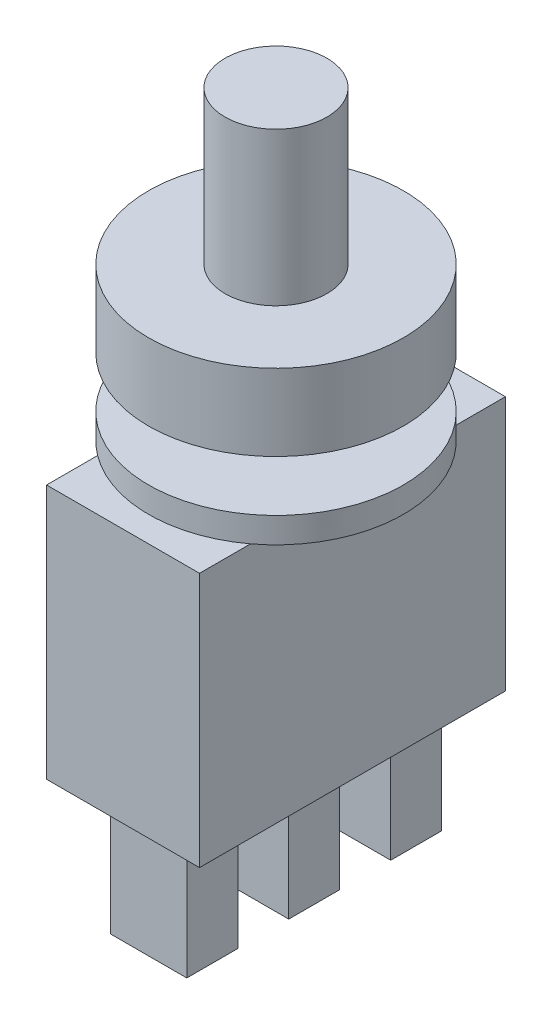
ISO-10303-21;
HEADER;
FILE_DESCRIPTION(('STEP AP214'),'2;1');
FILE_NAME('part.step','',(''),(''),'','','');
FILE_SCHEMA(('AUTOMOTIVE_DESIGN { 1 0 10303 214 1 1 1 1 }'));
ENDSEC;
DATA;
#1=APPLICATION_CONTEXT('core data for automotive mechanical design processes');
#2=APPLICATION_PROTOCOL_DEFINITION('international standard','automotive_design',2000,#1);
#3=PRODUCT_CONTEXT('',#1,'mechanical');
#4=PRODUCT('Part','Part','',(#3));
#5=PRODUCT_RELATED_PRODUCT_CATEGORY('part','',(#4));
#6=PRODUCT_DEFINITION_FORMATION('','',#4);
#7=PRODUCT_DEFINITION_CONTEXT('part definition',#1,'design');
#8=PRODUCT_DEFINITION('design','',#6,#7);
#9=PRODUCT_DEFINITION_SHAPE('','',#8);
#10=(LENGTH_UNIT() NAMED_UNIT(*) SI_UNIT(.MILLI.,.METRE.));
#11=(NAMED_UNIT(*) PLANE_ANGLE_UNIT() SI_UNIT($,.RADIAN.));
#12=(NAMED_UNIT(*) SI_UNIT($,.STERADIAN.) SOLID_ANGLE_UNIT());
#13=UNCERTAINTY_MEASURE_WITH_UNIT(LENGTH_MEASURE(1.E-05),#10,'distance_accuracy_value','');
#14=(GEOMETRIC_REPRESENTATION_CONTEXT(3) GLOBAL_UNCERTAINTY_ASSIGNED_CONTEXT((#13)) GLOBAL_UNIT_ASSIGNED_CONTEXT((#10,
#11,#12)) REPRESENTATION_CONTEXT('',''));
#15=CARTESIAN_POINT('',(0.,0.,0.));
#16=DIRECTION('',(0.,0.,1.));
#17=DIRECTION('',(1.,0.,0.));
#18=AXIS2_PLACEMENT_3D('',#15,#16,#17);
#19=CARTESIAN_POINT('',(3.,-13.,-6.));
#20=DIRECTION('',(0.,-1.,0.));
#21=DIRECTION('',(0.,0.,-1.));
#22=AXIS2_PLACEMENT_3D('',#19,#20,#21);
#23=PLANE('',#22);
#24=DIRECTION('',(1.,0.,0.));
#25=VECTOR('',#24,1.);
#26=CARTESIAN_POINT('',(-1.5,-13.,-1.));
#27=LINE('',#26,#25);
#28=CARTESIAN_POINT('',(-1.5,-13.,-1.));
#29=VERTEX_POINT('',#28);
#30=CARTESIAN_POINT('',(1.5,-13.,-1.));
#31=VERTEX_POINT('',#30);
#32=EDGE_CURVE('E202',#29,#31,#27,.T.);
#33=ORIENTED_EDGE('',*,*,#32,.F.);
#34=DIRECTION('',(0.,0.,-1.));
#35=VECTOR('',#34,1.);
#36=CARTESIAN_POINT('',(-1.5,-13.,-1.));
#37=LINE('',#36,#35);
#38=CARTESIAN_POINT('',(-1.5,-13.,1.));
#39=VERTEX_POINT('',#38);
#40=EDGE_CURVE('E171',#39,#29,#37,.T.);
#41=ORIENTED_EDGE('',*,*,#40,.F.);
#42=DIRECTION('',(-1.,0.,0.));
#43=VECTOR('',#42,1.);
#44=CARTESIAN_POINT('',(-1.5,-13.,1.));
#45=LINE('',#44,#43);
#46=CARTESIAN_POINT('',(1.5,-13.,1.));
#47=VERTEX_POINT('',#46);
#48=EDGE_CURVE('E206',#47,#39,#45,.T.);
#49=ORIENTED_EDGE('',*,*,#48,.F.);
#50=DIRECTION('',(0.,0.,1.));
#51=VECTOR('',#50,1.);
#52=CARTESIAN_POINT('',(1.5,-13.,-1.));
#53=LINE('',#52,#51);
#54=EDGE_CURVE('E204',#31,#47,#53,.T.);
#55=ORIENTED_EDGE('',*,*,#54,.F.);
#56=EDGE_LOOP('',(#33,#41,#49,#55));
#57=FACE_BOUND('',#56,.T.);
#58=DIRECTION('',(0.,0.,1.));
#59=VECTOR('',#58,1.);
#60=CARTESIAN_POINT('',(3.,-13.,-6.));
#61=LINE('',#60,#59);
#62=CARTESIAN_POINT('',(3.,-13.,-6.));
#63=VERTEX_POINT('',#62);
#64=CARTESIAN_POINT('',(3.,-13.,6.));
#65=VERTEX_POINT('',#64);
#66=EDGE_CURVE('E264',#63,#65,#61,.T.);
#67=ORIENTED_EDGE('',*,*,#66,.T.);
#68=DIRECTION('',(-1.,0.,0.));
#69=VECTOR('',#68,1.);
#70=CARTESIAN_POINT('',(3.,-13.,6.));
#71=LINE('',#70,#69);
#72=CARTESIAN_POINT('',(-3.,-13.,6.));
#73=VERTEX_POINT('',#72);
#74=EDGE_CURVE('E267',#65,#73,#71,.T.);
#75=ORIENTED_EDGE('',*,*,#74,.T.);
#76=DIRECTION('',(0.,0.,-1.));
#77=VECTOR('',#76,1.);
#78=CARTESIAN_POINT('',(-3.,-13.,-6.));
#79=LINE('',#78,#77);
#80=CARTESIAN_POINT('',(-3.,-13.,-6.));
#81=VERTEX_POINT('',#80);
#82=EDGE_CURVE('E269',#73,#81,#79,.T.);
#83=ORIENTED_EDGE('',*,*,#82,.T.);
#84=DIRECTION('',(1.,0.,0.));
#85=VECTOR('',#84,1.);
#86=CARTESIAN_POINT('',(3.,-13.,-6.));
#87=LINE('',#86,#85);
#88=EDGE_CURVE('E271',#81,#63,#87,.T.);
#89=ORIENTED_EDGE('',*,*,#88,.T.);
#90=EDGE_LOOP('',(#67,#75,#83,#89));
#91=FACE_BOUND('',#90,.T.);
#92=DIRECTION('',(1.,0.,0.));
#93=VECTOR('',#92,1.);
#94=CARTESIAN_POINT('',(-1.5,-13.,3.));
#95=LINE('',#94,#93);
#96=CARTESIAN_POINT('',(-1.5,-13.,3.));
#97=VERTEX_POINT('',#96);
#98=CARTESIAN_POINT('',(1.5,-13.,3.));
#99=VERTEX_POINT('',#98);
#100=EDGE_CURVE('E229',#97,#99,#95,.T.);
#101=ORIENTED_EDGE('',*,*,#100,.F.);
#102=DIRECTION('',(0.,0.,-1.));
#103=VECTOR('',#102,1.);
#104=CARTESIAN_POINT('',(-1.5,-13.,3.));
#105=LINE('',#104,#103);
#106=CARTESIAN_POINT('',(-1.5,-13.,5.));
#107=VERTEX_POINT('',#106);
#108=EDGE_CURVE('E226',#107,#97,#105,.T.);
#109=ORIENTED_EDGE('',*,*,#108,.F.);
#110=DIRECTION('',(-1.,0.,0.));
#111=VECTOR('',#110,1.);
#112=CARTESIAN_POINT('',(-1.5,-13.,5.));
#113=LINE('',#112,#111);
#114=CARTESIAN_POINT('',(1.5,-13.,5.));
#115=VERTEX_POINT('',#114);
#116=EDGE_CURVE('E234',#115,#107,#113,.T.);
#117=ORIENTED_EDGE('',*,*,#116,.F.);
#118=DIRECTION('',(0.,0.,1.));
#119=VECTOR('',#118,1.);
#120=CARTESIAN_POINT('',(1.5,-13.,3.));
#121=LINE('',#120,#119);
#122=EDGE_CURVE('E231',#99,#115,#121,.T.);
#123=ORIENTED_EDGE('',*,*,#122,.F.);
#124=EDGE_LOOP('',(#101,#109,#117,#123));
#125=FACE_BOUND('',#124,.T.);
#126=DIRECTION('',(1.,0.,0.));
#127=VECTOR('',#126,1.);
#128=CARTESIAN_POINT('',(-1.5,-13.,-5.));
#129=LINE('',#128,#127);
#130=CARTESIAN_POINT('',(-1.5,-13.,-5.));
#131=VERTEX_POINT('',#130);
#132=CARTESIAN_POINT('',(1.5,-13.,-5.));
#133=VERTEX_POINT('',#132);
#134=EDGE_CURVE('E165',#131,#133,#129,.T.);
#135=ORIENTED_EDGE('',*,*,#134,.F.);
#136=DIRECTION('',(0.,0.,-1.));
#137=VECTOR('',#136,1.);
#138=CARTESIAN_POINT('',(-1.5,-13.,-5.));
#139=LINE('',#138,#137);
#140=CARTESIAN_POINT('',(-1.5,-13.,-3.));
#141=VERTEX_POINT('',#140);
#142=EDGE_CURVE('E176',#141,#131,#139,.T.);
#143=ORIENTED_EDGE('',*,*,#142,.F.);
#144=DIRECTION('',(-1.,0.,0.));
#145=VECTOR('',#144,1.);
#146=CARTESIAN_POINT('',(-1.5,-13.,-3.));
#147=LINE('',#146,#145);
#148=CARTESIAN_POINT('',(1.5,-13.,-3.));
#149=VERTEX_POINT('',#148);
#150=EDGE_CURVE('E186',#149,#141,#147,.T.);
#151=ORIENTED_EDGE('',*,*,#150,.F.);
#152=DIRECTION('',(0.,0.,1.));
#153=VECTOR('',#152,1.);
#154=CARTESIAN_POINT('',(1.5,-13.,-5.));
#155=LINE('',#154,#153);
#156=EDGE_CURVE('E184',#133,#149,#155,.T.);
#157=ORIENTED_EDGE('',*,*,#156,.F.);
#158=EDGE_LOOP('',(#135,#143,#151,#157));
#159=FACE_BOUND('',#158,.T.);
#160=ADVANCED_FACE('F30',(#57,#91,#125,#159),#23,.T.);
#161=CARTESIAN_POINT('',(0.,-3.,0.));
#162=DIRECTION('',(0.,-1.,0.));
#163=DIRECTION('',(0.,0.,-1.));
#164=AXIS2_PLACEMENT_3D('',#161,#162,#163);
#165=PLANE('',#164);
#166=DIRECTION('',(0.,0.,1.));
#167=VECTOR('',#166,1.);
#168=CARTESIAN_POINT('',(3.,-3.,-6.));
#169=LINE('',#168,#167);
#170=CARTESIAN_POINT('',(3.,-3.,-4.));
#171=VERTEX_POINT('',#170);
#172=CARTESIAN_POINT('',(3.,-3.,4.));
#173=VERTEX_POINT('',#172);
#174=EDGE_CURVE('E11',#171,#173,#169,.T.);
#175=ORIENTED_EDGE('',*,*,#174,.F.);
#176=CARTESIAN_POINT('',(0.,-3.,0.));
#177=DIRECTION('',(0.,-1.,0.));
#178=DIRECTION('',(0.,0.,-1.));
#179=AXIS2_PLACEMENT_3D('',#176,#177,#178);
#180=CIRCLE('',#179,5.);
#181=EDGE_CURVE('E289',#171,#173,#180,.T.);
#182=ORIENTED_EDGE('',*,*,#181,.T.);
#183=EDGE_LOOP('',(#175,#182));
#184=FACE_BOUND('',#183,.T.);
#185=ADVANCED_FACE('F350',(#184),#165,.T.);
#186=CARTESIAN_POINT('',(0.,0.,0.));
#187=DIRECTION('',(0.,1.,0.));
#188=DIRECTION('',(0.,0.,1.));
#189=AXIS2_PLACEMENT_3D('',#186,#187,#188);
#190=PLANE('',#189);
#191=CARTESIAN_POINT('',(0.,0.,0.));
#192=DIRECTION('',(0.,1.,0.));
#193=DIRECTION('',(0.,0.,1.));
#194=AXIS2_PLACEMENT_3D('',#191,#192,#193);
#195=CIRCLE('',#194,5.);
#196=CARTESIAN_POINT('',(0.,0.,5.));
#197=VERTEX_POINT('',#196);
#198=EDGE_CURVE('E302',#197,#197,#195,.T.);
#199=ORIENTED_EDGE('',*,*,#198,.F.);
#200=EDGE_LOOP('',(#199));
#201=FACE_BOUND('',#200,.T.);
#202=CARTESIAN_POINT('',(0.,0.,0.));
#203=DIRECTION('',(0.,1.,0.));
#204=DIRECTION('',(0.,0.,1.));
#205=AXIS2_PLACEMENT_3D('',#202,#203,#204);
#206=CIRCLE('',#205,2.);
#207=CARTESIAN_POINT('',(0.,0.,2.));
#208=VERTEX_POINT('',#207);
#209=EDGE_CURVE('E34',#208,#208,#206,.F.);
#210=ORIENTED_EDGE('',*,*,#209,.F.);
#211=EDGE_LOOP('',(#210));
#212=FACE_BOUND('',#211,.T.);
#213=ADVANCED_FACE('F352',(#201,#212),#190,.F.);
#214=CARTESIAN_POINT('',(0.,3.,0.));
#215=DIRECTION('',(0.,1.,0.));
#216=DIRECTION('',(0.,0.,1.));
#217=AXIS2_PLACEMENT_3D('',#214,#215,#216);
#218=PLANE('',#217);
#219=CARTESIAN_POINT('',(0.,3.,0.));
#220=DIRECTION('',(0.,1.,0.));
#221=DIRECTION('',(0.,0.,1.));
#222=AXIS2_PLACEMENT_3D('',#219,#220,#221);
#223=CIRCLE('',#222,5.);
#224=CARTESIAN_POINT('',(0.,3.,5.));
#225=VERTEX_POINT('',#224);
#226=EDGE_CURVE('E304',#225,#225,#223,.T.);
#227=ORIENTED_EDGE('',*,*,#226,.T.);
#228=EDGE_LOOP('',(#227));
#229=FACE_BOUND('',#228,.T.);
#230=CARTESIAN_POINT('',(0.,3.,0.));
#231=DIRECTION('',(0.,1.,0.));
#232=DIRECTION('',(0.,0.,1.));
#233=AXIS2_PLACEMENT_3D('',#230,#231,#232);
#234=CIRCLE('',#233,2.);
#235=CARTESIAN_POINT('',(0.,3.,2.));
#236=VERTEX_POINT('',#235);
#237=EDGE_CURVE('E296',#236,#236,#234,.T.);
#238=ORIENTED_EDGE('',*,*,#237,.F.);
#239=EDGE_LOOP('',(#238));
#240=FACE_BOUND('',#239,.T.);
#241=ADVANCED_FACE('F358',(#229,#240),#218,.T.);
#242=CARTESIAN_POINT('',(0.,3.,0.));
#243=DIRECTION('',(0.,-1.,0.));
#244=DIRECTION('',(0.,0.,-1.));
#245=AXIS2_PLACEMENT_3D('',#242,#243,#244);
#246=CYLINDRICAL_SURFACE('',#245,5.);
#247=ORIENTED_EDGE('',*,*,#226,.F.);
#248=EDGE_LOOP('',(#247));
#249=FACE_BOUND('',#248,.T.);
#250=ORIENTED_EDGE('',*,*,#198,.T.);
#251=EDGE_LOOP('',(#250));
#252=FACE_BOUND('',#251,.T.);
#253=ADVANCED_FACE('F32',(#249,#252),#246,.T.);
#254=CARTESIAN_POINT('',(0.,9.,0.));
#255=DIRECTION('',(0.,-1.,0.));
#256=DIRECTION('',(0.,0.,-1.));
#257=AXIS2_PLACEMENT_3D('',#254,#255,#256);
#258=CYLINDRICAL_SURFACE('',#257,2.);
#259=CARTESIAN_POINT('',(0.,9.,0.));
#260=DIRECTION('',(0.,1.,0.));
#261=DIRECTION('',(0.,0.,1.));
#262=AXIS2_PLACEMENT_3D('',#259,#260,#261);
#263=CIRCLE('',#262,2.);
#264=CARTESIAN_POINT('',(0.,9.,2.));
#265=VERTEX_POINT('',#264);
#266=EDGE_CURVE('E299',#265,#265,#263,.T.);
#267=ORIENTED_EDGE('',*,*,#266,.F.);
#268=EDGE_LOOP('',(#267));
#269=FACE_BOUND('',#268,.T.);
#270=ORIENTED_EDGE('',*,*,#237,.T.);
#271=EDGE_LOOP('',(#270));
#272=FACE_BOUND('',#271,.T.);
#273=ADVANCED_FACE('F384',(#269,#272),#258,.T.);
#274=CARTESIAN_POINT('',(0.,9.,0.));
#275=DIRECTION('',(0.,1.,0.));
#276=DIRECTION('',(0.,0.,1.));
#277=AXIS2_PLACEMENT_3D('',#274,#275,#276);
#278=PLANE('',#277);
#279=ORIENTED_EDGE('',*,*,#266,.T.);
#280=EDGE_LOOP('',(#279));
#281=FACE_BOUND('',#280,.T.);
#282=ADVANCED_FACE('F380',(#281),#278,.T.);
#283=CARTESIAN_POINT('',(0.,-2.,0.));
#284=DIRECTION('',(0.,1.,0.));
#285=DIRECTION('',(0.,0.,1.));
#286=AXIS2_PLACEMENT_3D('',#283,#284,#285);
#287=CYLINDRICAL_SURFACE('',#286,2.);
#288=CARTESIAN_POINT('',(0.,-2.,0.));
#289=DIRECTION('',(0.,-1.,0.));
#290=DIRECTION('',(0.,0.,-1.));
#291=AXIS2_PLACEMENT_3D('',#288,#289,#290);
#292=CIRCLE('',#291,2.);
#293=CARTESIAN_POINT('',(0.,-2.,-2.));
#294=VERTEX_POINT('',#293);
#295=EDGE_CURVE('E292',#294,#294,#292,.T.);
#296=ORIENTED_EDGE('',*,*,#295,.F.);
#297=EDGE_LOOP('',(#296));
#298=FACE_BOUND('',#297,.T.);
#299=ORIENTED_EDGE('',*,*,#209,.T.);
#300=EDGE_LOOP('',(#299));
#301=FACE_BOUND('',#300,.T.);
#302=ADVANCED_FACE('F375',(#298,#301),#287,.T.);
#303=CARTESIAN_POINT('',(0.,-2.,0.));
#304=DIRECTION('',(0.,-1.,0.));
#305=DIRECTION('',(0.,0.,-1.));
#306=AXIS2_PLACEMENT_3D('',#303,#304,#305);
#307=PLANE('',#306);
#308=CARTESIAN_POINT('',(0.,-2.,0.));
#309=DIRECTION('',(0.,-1.,0.));
#310=DIRECTION('',(0.,0.,-1.));
#311=AXIS2_PLACEMENT_3D('',#308,#309,#310);
#312=CIRCLE('',#311,5.);
#313=CARTESIAN_POINT('',(0.,-2.,-5.));
#314=VERTEX_POINT('',#313);
#315=EDGE_CURVE('E285',#314,#314,#312,.T.);
#316=ORIENTED_EDGE('',*,*,#315,.F.);
#317=EDGE_LOOP('',(#316));
#318=FACE_BOUND('',#317,.T.);
#319=ORIENTED_EDGE('',*,*,#295,.T.);
#320=EDGE_LOOP('',(#319));
#321=FACE_BOUND('',#320,.T.);
#322=ADVANCED_FACE('F371',(#318,#321),#307,.F.);
#323=CARTESIAN_POINT('',(0.,-3.,0.));
#324=DIRECTION('',(0.,1.,0.));
#325=DIRECTION('',(0.,0.,1.));
#326=AXIS2_PLACEMENT_3D('',#323,#324,#325);
#327=CYLINDRICAL_SURFACE('',#326,5.);
#328=ORIENTED_EDGE('',*,*,#181,.F.);
#329=CARTESIAN_POINT('',(-3.,-3.,-4.));
#330=VERTEX_POINT('',#329);
#331=EDGE_CURVE('E288',#330,#171,#180,.T.);
#332=ORIENTED_EDGE('',*,*,#331,.F.);
#333=CARTESIAN_POINT('',(-3.,-3.,4.));
#334=VERTEX_POINT('',#333);
#335=EDGE_CURVE('E344',#334,#330,#180,.T.);
#336=ORIENTED_EDGE('',*,*,#335,.F.);
#337=EDGE_CURVE('E293',#173,#334,#180,.T.);
#338=ORIENTED_EDGE('',*,*,#337,.F.);
#339=EDGE_LOOP('',(#328,#332,#336,#338));
#340=FACE_BOUND('',#339,.T.);
#341=ORIENTED_EDGE('',*,*,#315,.T.);
#342=EDGE_LOOP('',(#341));
#343=FACE_BOUND('',#342,.T.);
#344=ADVANCED_FACE('F347',(#340,#343),#327,.T.);
#345=DIRECTION('',(0.,0.,-1.));
#346=VECTOR('',#345,1.);
#347=CARTESIAN_POINT('',(-3.,-3.,-6.));
#348=LINE('',#347,#346);
#349=EDGE_CURVE('E39',#334,#330,#348,.T.);
#350=ORIENTED_EDGE('',*,*,#349,.F.);
#351=ORIENTED_EDGE('',*,*,#335,.T.);
#352=EDGE_LOOP('',(#350,#351));
#353=FACE_BOUND('',#352,.T.);
#354=ADVANCED_FACE('F346',(#353),#165,.T.);
#355=CARTESIAN_POINT('',(3.,-3.,-6.));
#356=DIRECTION('',(0.,-1.,0.));
#357=DIRECTION('',(0.,0.,-1.));
#358=AXIS2_PLACEMENT_3D('',#355,#356,#357);
#359=PLANE('',#358);
#360=CARTESIAN_POINT('',(3.,-3.,6.));
#361=VERTEX_POINT('',#360);
#362=EDGE_CURVE('E42',#173,#361,#169,.T.);
#363=ORIENTED_EDGE('',*,*,#362,.F.);
#364=ORIENTED_EDGE('',*,*,#337,.T.);
#365=CARTESIAN_POINT('',(-3.,-3.,6.));
#366=VERTEX_POINT('',#365);
#367=EDGE_CURVE('E259',#366,#334,#348,.T.);
#368=ORIENTED_EDGE('',*,*,#367,.F.);
#369=DIRECTION('',(-1.,0.,0.));
#370=VECTOR('',#369,1.);
#371=CARTESIAN_POINT('',(3.,-3.,6.));
#372=LINE('',#371,#370);
#373=EDGE_CURVE('E256',#361,#366,#372,.T.);
#374=ORIENTED_EDGE('',*,*,#373,.F.);
#375=EDGE_LOOP('',(#363,#364,#368,#374));
#376=FACE_BOUND('',#375,.T.);
#377=ADVANCED_FACE('F340',(#376),#359,.F.);
#378=CARTESIAN_POINT('',(-3.,-3.,-6.));
#379=VERTEX_POINT('',#378);
#380=EDGE_CURVE('E258',#330,#379,#348,.T.);
#381=ORIENTED_EDGE('',*,*,#380,.F.);
#382=ORIENTED_EDGE('',*,*,#331,.T.);
#383=CARTESIAN_POINT('',(3.,-3.,-6.));
#384=VERTEX_POINT('',#383);
#385=EDGE_CURVE('E41',#384,#171,#169,.T.);
#386=ORIENTED_EDGE('',*,*,#385,.F.);
#387=DIRECTION('',(1.,0.,0.));
#388=VECTOR('',#387,1.);
#389=CARTESIAN_POINT('',(3.,-3.,-6.));
#390=LINE('',#389,#388);
#391=EDGE_CURVE('E262',#379,#384,#390,.T.);
#392=ORIENTED_EDGE('',*,*,#391,.F.);
#393=EDGE_LOOP('',(#381,#382,#386,#392));
#394=FACE_BOUND('',#393,.T.);
#395=ADVANCED_FACE('F325',(#394),#359,.F.);
#396=CARTESIAN_POINT('',(3.,-13.,-6.));
#397=DIRECTION('',(-1.,0.,0.));
#398=DIRECTION('',(0.,0.,1.));
#399=AXIS2_PLACEMENT_3D('',#396,#397,#398);
#400=PLANE('',#399);
#401=ORIENTED_EDGE('',*,*,#385,.T.);
#402=ORIENTED_EDGE('',*,*,#174,.T.);
#403=ORIENTED_EDGE('',*,*,#362,.T.);
#404=DIRECTION('',(0.,1.,0.));
#405=VECTOR('',#404,1.);
#406=CARTESIAN_POINT('',(3.,-13.,6.));
#407=LINE('',#406,#405);
#408=EDGE_CURVE('E282',#65,#361,#407,.T.);
#409=ORIENTED_EDGE('',*,*,#408,.F.);
#410=ORIENTED_EDGE('',*,*,#66,.F.);
#411=DIRECTION('',(0.,1.,0.));
#412=VECTOR('',#411,1.);
#413=CARTESIAN_POINT('',(3.,-13.,-6.));
#414=LINE('',#413,#412);
#415=EDGE_CURVE('E273',#63,#384,#414,.T.);
#416=ORIENTED_EDGE('',*,*,#415,.T.);
#417=EDGE_LOOP('',(#401,#402,#403,#409,#410,#416));
#418=FACE_BOUND('',#417,.T.);
#419=ADVANCED_FACE('F328',(#418),#400,.F.);
#420=CARTESIAN_POINT('',(3.,-13.,6.));
#421=DIRECTION('',(0.,0.,-1.));
#422=DIRECTION('',(-1.,0.,0.));
#423=AXIS2_PLACEMENT_3D('',#420,#421,#422);
#424=PLANE('',#423);
#425=ORIENTED_EDGE('',*,*,#373,.T.);
#426=DIRECTION('',(0.,1.,0.));
#427=VECTOR('',#426,1.);
#428=CARTESIAN_POINT('',(-3.,-13.,6.));
#429=LINE('',#428,#427);
#430=EDGE_CURVE('E279',#73,#366,#429,.T.);
#431=ORIENTED_EDGE('',*,*,#430,.F.);
#432=ORIENTED_EDGE('',*,*,#74,.F.);
#433=ORIENTED_EDGE('',*,*,#408,.T.);
#434=EDGE_LOOP('',(#425,#431,#432,#433));
#435=FACE_BOUND('',#434,.T.);
#436=ADVANCED_FACE('F452',(#435),#424,.F.);
#437=CARTESIAN_POINT('',(-3.,-13.,-6.));
#438=DIRECTION('',(1.,0.,0.));
#439=DIRECTION('',(0.,0.,-1.));
#440=AXIS2_PLACEMENT_3D('',#437,#438,#439);
#441=PLANE('',#440);
#442=ORIENTED_EDGE('',*,*,#367,.T.);
#443=ORIENTED_EDGE('',*,*,#349,.T.);
#444=ORIENTED_EDGE('',*,*,#380,.T.);
#445=DIRECTION('',(0.,1.,0.));
#446=VECTOR('',#445,1.);
#447=CARTESIAN_POINT('',(-3.,-13.,-6.));
#448=LINE('',#447,#446);
#449=EDGE_CURVE('E276',#81,#379,#448,.T.);
#450=ORIENTED_EDGE('',*,*,#449,.F.);
#451=ORIENTED_EDGE('',*,*,#82,.F.);
#452=ORIENTED_EDGE('',*,*,#430,.T.);
#453=EDGE_LOOP('',(#442,#443,#444,#450,#451,#452));
#454=FACE_BOUND('',#453,.T.);
#455=ADVANCED_FACE('F315',(#454),#441,.F.);
#456=CARTESIAN_POINT('',(3.,-13.,-6.));
#457=DIRECTION('',(0.,0.,1.));
#458=DIRECTION('',(1.,0.,0.));
#459=AXIS2_PLACEMENT_3D('',#456,#457,#458);
#460=PLANE('',#459);
#461=ORIENTED_EDGE('',*,*,#391,.T.);
#462=ORIENTED_EDGE('',*,*,#415,.F.);
#463=ORIENTED_EDGE('',*,*,#88,.F.);
#464=ORIENTED_EDGE('',*,*,#449,.T.);
#465=EDGE_LOOP('',(#461,#462,#463,#464));
#466=FACE_BOUND('',#465,.T.);
#467=ADVANCED_FACE('F322',(#466),#460,.F.);
#468=CARTESIAN_POINT('',(-1.5,-18.,3.));
#469=DIRECTION('',(1.,0.,0.));
#470=DIRECTION('',(0.,0.,-1.));
#471=AXIS2_PLACEMENT_3D('',#468,#469,#470);
#472=PLANE('',#471);
#473=ORIENTED_EDGE('',*,*,#108,.T.);
#474=DIRECTION('',(0.,1.,0.));
#475=VECTOR('',#474,1.);
#476=CARTESIAN_POINT('',(-1.5,-18.,3.));
#477=LINE('',#476,#475);
#478=CARTESIAN_POINT('',(-1.5,-18.,3.));
#479=VERTEX_POINT('',#478);
#480=EDGE_CURVE('E253',#479,#97,#477,.T.);
#481=ORIENTED_EDGE('',*,*,#480,.F.);
#482=DIRECTION('',(0.,0.,-1.));
#483=VECTOR('',#482,1.);
#484=CARTESIAN_POINT('',(-1.5,-18.,3.));
#485=LINE('',#484,#483);
#486=CARTESIAN_POINT('',(-1.5,-18.,5.));
#487=VERTEX_POINT('',#486);
#488=EDGE_CURVE('E236',#487,#479,#485,.T.);
#489=ORIENTED_EDGE('',*,*,#488,.F.);
#490=DIRECTION('',(0.,1.,0.));
#491=VECTOR('',#490,1.);
#492=CARTESIAN_POINT('',(-1.5,-18.,5.));
#493=LINE('',#492,#491);
#494=EDGE_CURVE('E245',#487,#107,#493,.T.);
#495=ORIENTED_EDGE('',*,*,#494,.T.);
#496=EDGE_LOOP('',(#473,#481,#489,#495));
#497=FACE_BOUND('',#496,.T.);
#498=ADVANCED_FACE('F477',(#497),#472,.F.);
#499=CARTESIAN_POINT('',(-1.5,-18.,3.));
#500=DIRECTION('',(0.,0.,1.));
#501=DIRECTION('',(1.,0.,0.));
#502=AXIS2_PLACEMENT_3D('',#499,#500,#501);
#503=PLANE('',#502);
#504=ORIENTED_EDGE('',*,*,#100,.T.);
#505=DIRECTION('',(0.,1.,0.));
#506=VECTOR('',#505,1.);
#507=CARTESIAN_POINT('',(1.5,-18.,3.));
#508=LINE('',#507,#506);
#509=CARTESIAN_POINT('',(1.5,-18.,3.));
#510=VERTEX_POINT('',#509);
#511=EDGE_CURVE('E250',#510,#99,#508,.T.);
#512=ORIENTED_EDGE('',*,*,#511,.F.);
#513=DIRECTION('',(1.,0.,0.));
#514=VECTOR('',#513,1.);
#515=CARTESIAN_POINT('',(-1.5,-18.,3.));
#516=LINE('',#515,#514);
#517=EDGE_CURVE('E239',#479,#510,#516,.T.);
#518=ORIENTED_EDGE('',*,*,#517,.F.);
#519=ORIENTED_EDGE('',*,*,#480,.T.);
#520=EDGE_LOOP('',(#504,#512,#518,#519));
#521=FACE_BOUND('',#520,.T.);
#522=ADVANCED_FACE('F492',(#521),#503,.F.);
#523=CARTESIAN_POINT('',(1.5,-18.,3.));
#524=DIRECTION('',(-1.,0.,0.));
#525=DIRECTION('',(0.,0.,1.));
#526=AXIS2_PLACEMENT_3D('',#523,#524,#525);
#527=PLANE('',#526);
#528=ORIENTED_EDGE('',*,*,#122,.T.);
#529=DIRECTION('',(0.,1.,0.));
#530=VECTOR('',#529,1.);
#531=CARTESIAN_POINT('',(1.5,-18.,5.));
#532=LINE('',#531,#530);
#533=CARTESIAN_POINT('',(1.5,-18.,5.));
#534=VERTEX_POINT('',#533);
#535=EDGE_CURVE('E248',#534,#115,#532,.T.);
#536=ORIENTED_EDGE('',*,*,#535,.F.);
#537=DIRECTION('',(0.,0.,1.));
#538=VECTOR('',#537,1.);
#539=CARTESIAN_POINT('',(1.5,-18.,3.));
#540=LINE('',#539,#538);
#541=EDGE_CURVE('E241',#510,#534,#540,.T.);
#542=ORIENTED_EDGE('',*,*,#541,.F.);
#543=ORIENTED_EDGE('',*,*,#511,.T.);
#544=EDGE_LOOP('',(#528,#536,#542,#543));
#545=FACE_BOUND('',#544,.T.);
#546=ADVANCED_FACE('F502',(#545),#527,.F.);
#547=CARTESIAN_POINT('',(-1.5,-18.,5.));
#548=DIRECTION('',(0.,0.,-1.));
#549=DIRECTION('',(-1.,0.,0.));
#550=AXIS2_PLACEMENT_3D('',#547,#548,#549);
#551=PLANE('',#550);
#552=ORIENTED_EDGE('',*,*,#116,.T.);
#553=ORIENTED_EDGE('',*,*,#494,.F.);
#554=DIRECTION('',(-1.,0.,0.));
#555=VECTOR('',#554,1.);
#556=CARTESIAN_POINT('',(-1.5,-18.,5.));
#557=LINE('',#556,#555);
#558=EDGE_CURVE('E243',#534,#487,#557,.T.);
#559=ORIENTED_EDGE('',*,*,#558,.F.);
#560=ORIENTED_EDGE('',*,*,#535,.T.);
#561=EDGE_LOOP('',(#552,#553,#559,#560));
#562=FACE_BOUND('',#561,.T.);
#563=ADVANCED_FACE('F512',(#562),#551,.F.);
#564=CARTESIAN_POINT('',(-1.5,-18.,5.));
#565=DIRECTION('',(0.,1.,0.));
#566=DIRECTION('',(0.,0.,1.));
#567=AXIS2_PLACEMENT_3D('',#564,#565,#566);
#568=PLANE('',#567);
#569=ORIENTED_EDGE('',*,*,#488,.T.);
#570=ORIENTED_EDGE('',*,*,#517,.T.);
#571=ORIENTED_EDGE('',*,*,#541,.T.);
#572=ORIENTED_EDGE('',*,*,#558,.T.);
#573=EDGE_LOOP('',(#569,#570,#571,#572));
#574=FACE_BOUND('',#573,.T.);
#575=ADVANCED_FACE('F522',(#574),#568,.F.);
#576=CARTESIAN_POINT('',(-1.5,-18.,-1.));
#577=DIRECTION('',(1.,0.,0.));
#578=DIRECTION('',(0.,0.,-1.));
#579=AXIS2_PLACEMENT_3D('',#576,#577,#578);
#580=PLANE('',#579);
#581=ORIENTED_EDGE('',*,*,#40,.T.);
#582=DIRECTION('',(0.,1.,0.));
#583=VECTOR('',#582,1.);
#584=CARTESIAN_POINT('',(-1.5,-18.,-1.));
#585=LINE('',#584,#583);
#586=CARTESIAN_POINT('',(-1.5,-18.,-1.));
#587=VERTEX_POINT('',#586);
#588=EDGE_CURVE('E224',#587,#29,#585,.T.);
#589=ORIENTED_EDGE('',*,*,#588,.F.);
#590=DIRECTION('',(0.,0.,-1.));
#591=VECTOR('',#590,1.);
#592=CARTESIAN_POINT('',(-1.5,-18.,-1.));
#593=LINE('',#592,#591);
#594=CARTESIAN_POINT('',(-1.5,-18.,1.));
#595=VERTEX_POINT('',#594);
#596=EDGE_CURVE('E208',#595,#587,#593,.T.);
#597=ORIENTED_EDGE('',*,*,#596,.F.);
#598=DIRECTION('',(0.,1.,0.));
#599=VECTOR('',#598,1.);
#600=CARTESIAN_POINT('',(-1.5,-18.,1.));
#601=LINE('',#600,#599);
#602=EDGE_CURVE('E217',#595,#39,#601,.T.);
#603=ORIENTED_EDGE('',*,*,#602,.T.);
#604=EDGE_LOOP('',(#581,#589,#597,#603));
#605=FACE_BOUND('',#604,.T.);
#606=ADVANCED_FACE('F532',(#605),#580,.F.);
#607=CARTESIAN_POINT('',(-1.5,-18.,-1.));
#608=DIRECTION('',(0.,0.,1.));
#609=DIRECTION('',(1.,0.,0.));
#610=AXIS2_PLACEMENT_3D('',#607,#608,#609);
#611=PLANE('',#610);
#612=ORIENTED_EDGE('',*,*,#32,.T.);
#613=DIRECTION('',(0.,1.,0.));
#614=VECTOR('',#613,1.);
#615=CARTESIAN_POINT('',(1.5,-18.,-1.));
#616=LINE('',#615,#614);
#617=CARTESIAN_POINT('',(1.5,-18.,-1.));
#618=VERTEX_POINT('',#617);
#619=EDGE_CURVE('E221',#618,#31,#616,.T.);
#620=ORIENTED_EDGE('',*,*,#619,.F.);
#621=DIRECTION('',(1.,0.,0.));
#622=VECTOR('',#621,1.);
#623=CARTESIAN_POINT('',(-1.5,-18.,-1.));
#624=LINE('',#623,#622);
#625=EDGE_CURVE('E211',#587,#618,#624,.T.);
#626=ORIENTED_EDGE('',*,*,#625,.F.);
#627=ORIENTED_EDGE('',*,*,#588,.T.);
#628=EDGE_LOOP('',(#612,#620,#626,#627));
#629=FACE_BOUND('',#628,.T.);
#630=ADVANCED_FACE('F542',(#629),#611,.F.);
#631=CARTESIAN_POINT('',(1.5,-18.,-1.));
#632=DIRECTION('',(-1.,0.,0.));
#633=DIRECTION('',(0.,0.,1.));
#634=AXIS2_PLACEMENT_3D('',#631,#632,#633);
#635=PLANE('',#634);
#636=ORIENTED_EDGE('',*,*,#54,.T.);
#637=DIRECTION('',(0.,1.,0.));
#638=VECTOR('',#637,1.);
#639=CARTESIAN_POINT('',(1.5,-18.,1.));
#640=LINE('',#639,#638);
#641=CARTESIAN_POINT('',(1.5,-18.,1.));
#642=VERTEX_POINT('',#641);
#643=EDGE_CURVE('E57',#642,#47,#640,.T.);
#644=ORIENTED_EDGE('',*,*,#643,.F.);
#645=DIRECTION('',(0.,0.,1.));
#646=VECTOR('',#645,1.);
#647=CARTESIAN_POINT('',(1.5,-18.,-1.));
#648=LINE('',#647,#646);
#649=EDGE_CURVE('E213',#618,#642,#648,.T.);
#650=ORIENTED_EDGE('',*,*,#649,.F.);
#651=ORIENTED_EDGE('',*,*,#619,.T.);
#652=EDGE_LOOP('',(#636,#644,#650,#651));
#653=FACE_BOUND('',#652,.T.);
#654=ADVANCED_FACE('F552',(#653),#635,.F.);
#655=CARTESIAN_POINT('',(-1.5,-18.,1.));
#656=DIRECTION('',(0.,0.,-1.));
#657=DIRECTION('',(-1.,0.,0.));
#658=AXIS2_PLACEMENT_3D('',#655,#656,#657);
#659=PLANE('',#658);
#660=ORIENTED_EDGE('',*,*,#48,.T.);
#661=ORIENTED_EDGE('',*,*,#602,.F.);
#662=DIRECTION('',(-1.,0.,0.));
#663=VECTOR('',#662,1.);
#664=CARTESIAN_POINT('',(-1.5,-18.,1.));
#665=LINE('',#664,#663);
#666=EDGE_CURVE('E215',#642,#595,#665,.T.);
#667=ORIENTED_EDGE('',*,*,#666,.F.);
#668=ORIENTED_EDGE('',*,*,#643,.T.);
#669=EDGE_LOOP('',(#660,#661,#667,#668));
#670=FACE_BOUND('',#669,.T.);
#671=ADVANCED_FACE('F562',(#670),#659,.F.);
#672=CARTESIAN_POINT('',(-1.5,-18.,1.));
#673=DIRECTION('',(0.,1.,0.));
#674=DIRECTION('',(0.,0.,1.));
#675=AXIS2_PLACEMENT_3D('',#672,#673,#674);
#676=PLANE('',#675);
#677=ORIENTED_EDGE('',*,*,#596,.T.);
#678=ORIENTED_EDGE('',*,*,#625,.T.);
#679=ORIENTED_EDGE('',*,*,#649,.T.);
#680=ORIENTED_EDGE('',*,*,#666,.T.);
#681=EDGE_LOOP('',(#677,#678,#679,#680));
#682=FACE_BOUND('',#681,.T.);
#683=ADVANCED_FACE('F572',(#682),#676,.F.);
#684=CARTESIAN_POINT('',(-1.5,-18.,-5.));
#685=DIRECTION('',(1.,0.,0.));
#686=DIRECTION('',(0.,0.,-1.));
#687=AXIS2_PLACEMENT_3D('',#684,#685,#686);
#688=PLANE('',#687);
#689=ORIENTED_EDGE('',*,*,#142,.T.);
#690=DIRECTION('',(0.,1.,0.));
#691=VECTOR('',#690,1.);
#692=CARTESIAN_POINT('',(-1.5,-18.,-5.));
#693=LINE('',#692,#691);
#694=CARTESIAN_POINT('',(-1.5,-18.,-5.));
#695=VERTEX_POINT('',#694);
#696=EDGE_CURVE('E160',#695,#131,#693,.T.);
#697=ORIENTED_EDGE('',*,*,#696,.F.);
#698=DIRECTION('',(0.,0.,-1.));
#699=VECTOR('',#698,1.);
#700=CARTESIAN_POINT('',(-1.5,-18.,-5.));
#701=LINE('',#700,#699);
#702=CARTESIAN_POINT('',(-1.5,-18.,-3.));
#703=VERTEX_POINT('',#702);
#704=EDGE_CURVE('E190',#703,#695,#701,.T.);
#705=ORIENTED_EDGE('',*,*,#704,.F.);
#706=DIRECTION('',(0.,1.,0.));
#707=VECTOR('',#706,1.);
#708=CARTESIAN_POINT('',(-1.5,-18.,-3.));
#709=LINE('',#708,#707);
#710=EDGE_CURVE('E179',#703,#141,#709,.T.);
#711=ORIENTED_EDGE('',*,*,#710,.T.);
#712=EDGE_LOOP('',(#689,#697,#705,#711));
#713=FACE_BOUND('',#712,.T.);
#714=ADVANCED_FACE('F177',(#713),#688,.F.);
#715=CARTESIAN_POINT('',(-1.5,-18.,-5.));
#716=DIRECTION('',(0.,0.,1.));
#717=DIRECTION('',(1.,0.,0.));
#718=AXIS2_PLACEMENT_3D('',#715,#716,#717);
#719=PLANE('',#718);
#720=ORIENTED_EDGE('',*,*,#134,.T.);
#721=DIRECTION('',(0.,1.,0.));
#722=VECTOR('',#721,1.);
#723=CARTESIAN_POINT('',(1.5,-18.,-5.));
#724=LINE('',#723,#722);
#725=CARTESIAN_POINT('',(1.5,-18.,-5.));
#726=VERTEX_POINT('',#725);
#727=EDGE_CURVE('E172',#726,#133,#724,.T.);
#728=ORIENTED_EDGE('',*,*,#727,.F.);
#729=DIRECTION('',(1.,0.,0.));
#730=VECTOR('',#729,1.);
#731=CARTESIAN_POINT('',(-1.5,-18.,-5.));
#732=LINE('',#731,#730);
#733=EDGE_CURVE('E167',#695,#726,#732,.T.);
#734=ORIENTED_EDGE('',*,*,#733,.F.);
#735=ORIENTED_EDGE('',*,*,#696,.T.);
#736=EDGE_LOOP('',(#720,#728,#734,#735));
#737=FACE_BOUND('',#736,.T.);
#738=ADVANCED_FACE('F162',(#737),#719,.F.);
#739=CARTESIAN_POINT('',(1.5,-18.,-5.));
#740=DIRECTION('',(-1.,0.,0.));
#741=DIRECTION('',(0.,0.,1.));
#742=AXIS2_PLACEMENT_3D('',#739,#740,#741);
#743=PLANE('',#742);
#744=ORIENTED_EDGE('',*,*,#156,.T.);
#745=DIRECTION('',(0.,1.,0.));
#746=VECTOR('',#745,1.);
#747=CARTESIAN_POINT('',(1.5,-18.,-3.));
#748=LINE('',#747,#746);
#749=CARTESIAN_POINT('',(1.5,-18.,-3.));
#750=VERTEX_POINT('',#749);
#751=EDGE_CURVE('E49',#750,#149,#748,.T.);
#752=ORIENTED_EDGE('',*,*,#751,.F.);
#753=DIRECTION('',(0.,0.,1.));
#754=VECTOR('',#753,1.);
#755=CARTESIAN_POINT('',(1.5,-18.,-5.));
#756=LINE('',#755,#754);
#757=EDGE_CURVE('E193',#726,#750,#756,.T.);
#758=ORIENTED_EDGE('',*,*,#757,.F.);
#759=ORIENTED_EDGE('',*,*,#727,.T.);
#760=EDGE_LOOP('',(#744,#752,#758,#759));
#761=FACE_BOUND('',#760,.T.);
#762=ADVANCED_FACE('F598',(#761),#743,.F.);
#763=CARTESIAN_POINT('',(-1.5,-18.,-3.));
#764=DIRECTION('',(0.,0.,-1.));
#765=DIRECTION('',(-1.,0.,0.));
#766=AXIS2_PLACEMENT_3D('',#763,#764,#765);
#767=PLANE('',#766);
#768=ORIENTED_EDGE('',*,*,#150,.T.);
#769=ORIENTED_EDGE('',*,*,#710,.F.);
#770=DIRECTION('',(-1.,0.,0.));
#771=VECTOR('',#770,1.);
#772=CARTESIAN_POINT('',(-1.5,-18.,-3.));
#773=LINE('',#772,#771);
#774=EDGE_CURVE('E195',#750,#703,#773,.T.);
#775=ORIENTED_EDGE('',*,*,#774,.F.);
#776=ORIENTED_EDGE('',*,*,#751,.T.);
#777=EDGE_LOOP('',(#768,#769,#775,#776));
#778=FACE_BOUND('',#777,.T.);
#779=ADVANCED_FACE('F607',(#778),#767,.F.);
#780=CARTESIAN_POINT('',(-1.5,-18.,-3.));
#781=DIRECTION('',(0.,1.,0.));
#782=DIRECTION('',(0.,0.,1.));
#783=AXIS2_PLACEMENT_3D('',#780,#781,#782);
#784=PLANE('',#783);
#785=ORIENTED_EDGE('',*,*,#704,.T.);
#786=ORIENTED_EDGE('',*,*,#733,.T.);
#787=ORIENTED_EDGE('',*,*,#757,.T.);
#788=ORIENTED_EDGE('',*,*,#774,.T.);
#789=EDGE_LOOP('',(#785,#786,#787,#788));
#790=FACE_BOUND('',#789,.T.);
#791=ADVANCED_FACE('F617',(#790),#784,.F.);
#792=CLOSED_SHELL('',(#160,#185,#213,#241,#253,#273,#282,#302,#322,#344,#354,#377,#395,#419,
#436,#455,#467,#498,#522,#546,#563,#575,#606,#630,#654,#671,#683,#714,#738,#762,#779,#791));
#793=MANIFOLD_SOLID_BREP('B2',#792);
#794=ADVANCED_BREP_SHAPE_REPRESENTATION('',(#18,#793),#14);
#795=SHAPE_DEFINITION_REPRESENTATION(#9,#794);
ENDSEC;
END-ISO-10303-21;
